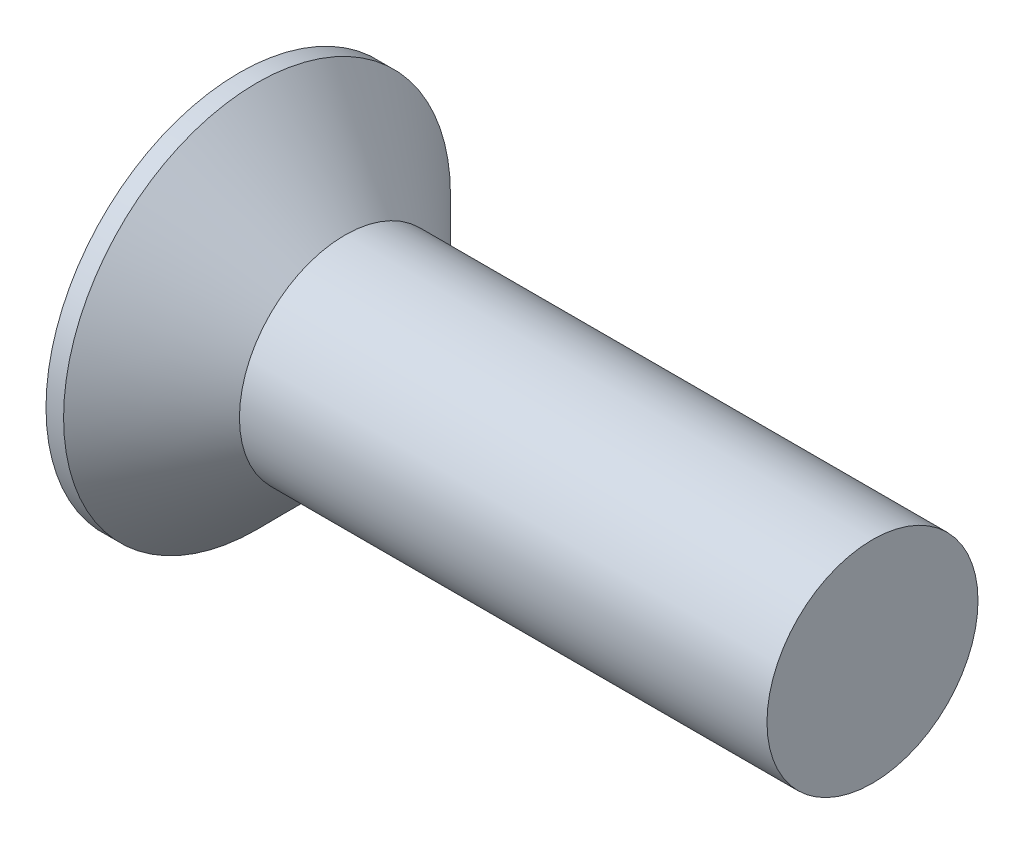
ISO-10303-21;
HEADER;
FILE_DESCRIPTION(('STEP AP214'),'2;1');
FILE_NAME('part.step','',(''),(''),'','','');
FILE_SCHEMA(('AUTOMOTIVE_DESIGN { 1 0 10303 214 1 1 1 1 }'));
ENDSEC;
DATA;
#1=APPLICATION_CONTEXT('core data for automotive mechanical design processes');
#2=APPLICATION_PROTOCOL_DEFINITION('international standard','automotive_design',2000,#1);
#3=PRODUCT_CONTEXT('',#1,'mechanical');
#4=PRODUCT('Part','Part','',(#3));
#5=PRODUCT_RELATED_PRODUCT_CATEGORY('part','',(#4));
#6=PRODUCT_DEFINITION_FORMATION('','',#4);
#7=PRODUCT_DEFINITION_CONTEXT('part definition',#1,'design');
#8=PRODUCT_DEFINITION('design','',#6,#7);
#9=PRODUCT_DEFINITION_SHAPE('','',#8);
#10=(LENGTH_UNIT() NAMED_UNIT(*) SI_UNIT(.MILLI.,.METRE.));
#11=(NAMED_UNIT(*) PLANE_ANGLE_UNIT() SI_UNIT($,.RADIAN.));
#12=(NAMED_UNIT(*) SI_UNIT($,.STERADIAN.) SOLID_ANGLE_UNIT());
#13=UNCERTAINTY_MEASURE_WITH_UNIT(LENGTH_MEASURE(1.E-05),#10,'distance_accuracy_value','');
#14=(GEOMETRIC_REPRESENTATION_CONTEXT(3) GLOBAL_UNCERTAINTY_ASSIGNED_CONTEXT((#13)) GLOBAL_UNIT_ASSIGNED_CONTEXT((#10,
#11,#12)) REPRESENTATION_CONTEXT('',''));
#15=CARTESIAN_POINT('',(0.,0.,0.));
#16=DIRECTION('',(0.,0.,1.));
#17=DIRECTION('',(1.,0.,0.));
#18=AXIS2_PLACEMENT_3D('',#15,#16,#17);
#19=CARTESIAN_POINT('',(-3.,0.,0.));
#20=DIRECTION('',(1.,0.,0.));
#21=DIRECTION('',(0.,0.,-1.00000000000001));
#22=AXIS2_PLACEMENT_3D('',#19,#20,#21);
#23=PLANE('',#22);
#24=CARTESIAN_POINT('',(-3.,0.,0.));
#25=DIRECTION('',(-1.,0.,0.));
#26=DIRECTION('',(0.,0.,1.00000000000001));
#27=AXIS2_PLACEMENT_3D('',#24,#25,#26);
#28=CIRCLE('',#27,5.5);
#29=CARTESIAN_POINT('',(-3.,0.,5.50000000000006));
#30=VERTEX_POINT('',#29);
#31=EDGE_CURVE('E10',#30,#30,#28,.T.);
#32=ORIENTED_EDGE('',*,*,#31,.T.);
#33=EDGE_LOOP('',(#32));
#34=FACE_BOUND('',#33,.T.);
#35=ADVANCED_FACE('F34',(#34),#23,.F.);
#36=CARTESIAN_POINT('',(-1000.,0.,1.52655665885959E-13));
#37=DIRECTION('',(-1.,0.,0.));
#38=DIRECTION('',(0.,0.,1.00000000000001));
#39=AXIS2_PLACEMENT_3D('',#36,#37,#38);
#40=CYLINDRICAL_SURFACE('',#39,5.5);
#41=ORIENTED_EDGE('',*,*,#31,.F.);
#42=EDGE_LOOP('',(#41));
#43=FACE_BOUND('',#42,.T.);
#44=CARTESIAN_POINT('',(-2.49999999999995,0.,0.));
#45=DIRECTION('',(-1.,0.,0.));
#46=DIRECTION('',(0.,0.,1.00000000000001));
#47=AXIS2_PLACEMENT_3D('',#44,#45,#46);
#48=CIRCLE('',#47,5.5);
#49=CARTESIAN_POINT('',(-2.49999999999995,0.,5.50000000000006));
#50=VERTEX_POINT('',#49);
#51=EDGE_CURVE('E40',#50,#50,#48,.T.);
#52=ORIENTED_EDGE('',*,*,#51,.T.);
#53=EDGE_LOOP('',(#52));
#54=FACE_BOUND('',#53,.T.);
#55=ADVANCED_FACE('F66',(#43,#54),#40,.T.);
#56=CARTESIAN_POINT('',(0.,0.,0.));
#57=DIRECTION('',(-1.,0.,0.));
#58=DIRECTION('',(0.,0.,1.00000000000001));
#59=AXIS2_PLACEMENT_3D('',#56,#57,#58);
#60=CONICAL_SURFACE('',#59,3.,0.785398163397458);
#61=ORIENTED_EDGE('',*,*,#51,.F.);
#62=EDGE_LOOP('',(#61));
#63=FACE_BOUND('',#62,.T.);
#64=CARTESIAN_POINT('',(0.,0.,0.));
#65=DIRECTION('',(-1.,0.,0.));
#66=DIRECTION('',(0.,0.,1.00000000000001));
#67=AXIS2_PLACEMENT_3D('',#64,#65,#66);
#68=CIRCLE('',#67,3.);
#69=CARTESIAN_POINT('',(0.,0.,3.00000000000003));
#70=VERTEX_POINT('',#69);
#71=EDGE_CURVE('E44',#70,#70,#68,.T.);
#72=ORIENTED_EDGE('',*,*,#71,.T.);
#73=EDGE_LOOP('',(#72));
#74=FACE_BOUND('',#73,.T.);
#75=ADVANCED_FACE('F62',(#63,#74),#60,.T.);
#76=CARTESIAN_POINT('',(-1000.,0.,1.52655665885959E-13));
#77=DIRECTION('',(-1.,0.,0.));
#78=DIRECTION('',(0.,0.,1.00000000000001));
#79=AXIS2_PLACEMENT_3D('',#76,#77,#78);
#80=CYLINDRICAL_SURFACE('',#79,3.);
#81=ORIENTED_EDGE('',*,*,#71,.F.);
#82=EDGE_LOOP('',(#81));
#83=FACE_BOUND('',#82,.T.);
#84=CARTESIAN_POINT('',(14.9999999999999,0.,3.88578058618805E-13));
#85=DIRECTION('',(-1.,0.,0.));
#86=DIRECTION('',(0.,0.,1.00000000000001));
#87=AXIS2_PLACEMENT_3D('',#84,#85,#86);
#88=CIRCLE('',#87,3.);
#89=CARTESIAN_POINT('',(14.9999999999999,0.,3.00000000000042));
#90=VERTEX_POINT('',#89);
#91=EDGE_CURVE('E48',#90,#90,#88,.T.);
#92=ORIENTED_EDGE('',*,*,#91,.T.);
#93=EDGE_LOOP('',(#92));
#94=FACE_BOUND('',#93,.T.);
#95=ADVANCED_FACE('F54',(#83,#94),#80,.T.);
#96=CARTESIAN_POINT('',(15.,3.00000000000017,3.46944695195361E-13));
#97=DIRECTION('',(-1.,0.,0.));
#98=DIRECTION('',(0.,0.,1.00000000000001));
#99=AXIS2_PLACEMENT_3D('',#96,#97,#98);
#100=PLANE('',#99);
#101=ORIENTED_EDGE('',*,*,#91,.F.);
#102=EDGE_LOOP('',(#101));
#103=FACE_BOUND('',#102,.T.);
#104=ADVANCED_FACE('F56',(#103),#100,.F.);
#105=CLOSED_SHELL('',(#35,#55,#75,#95,#104));
#106=MANIFOLD_SOLID_BREP('B2',#105);
#107=ADVANCED_BREP_SHAPE_REPRESENTATION('',(#18,#106),#14);
#108=SHAPE_DEFINITION_REPRESENTATION(#9,#107);
ENDSEC;
END-ISO-10303-21;
